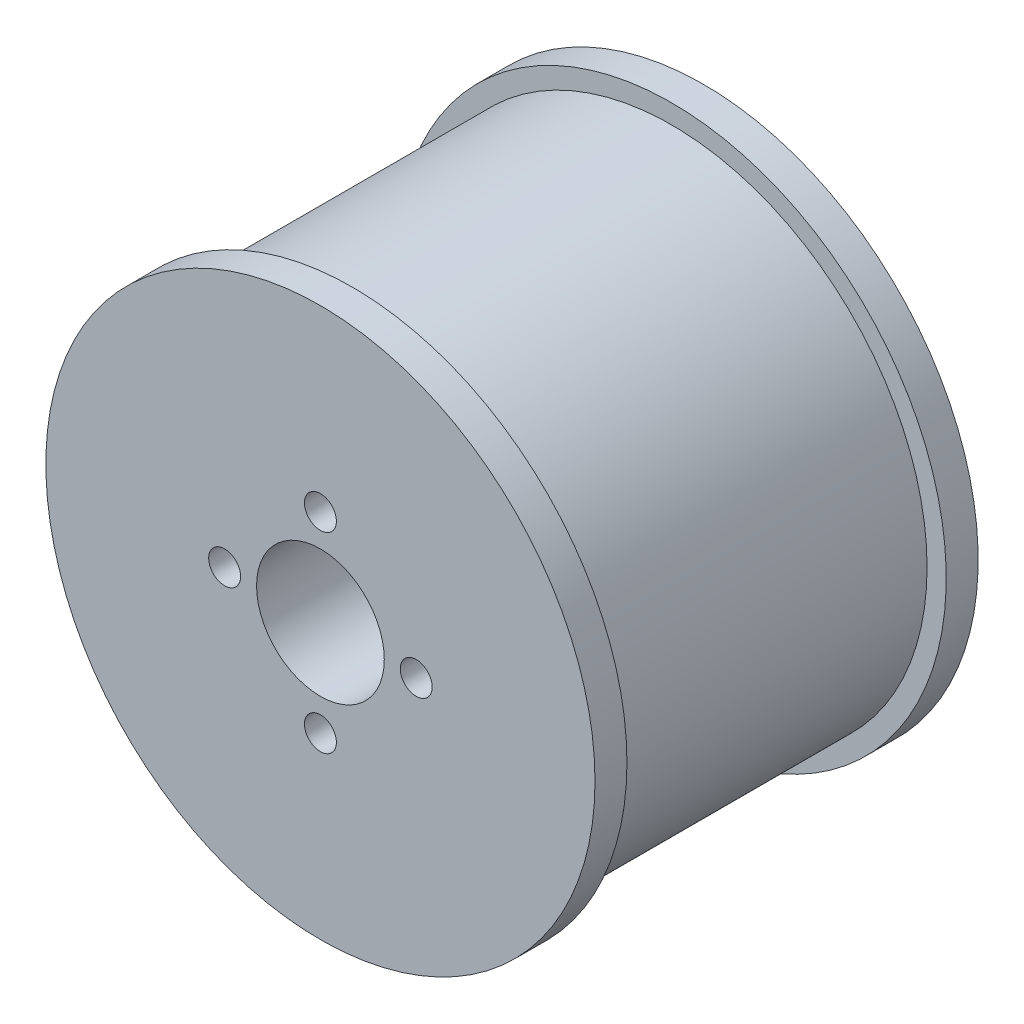
ISO-10303-21;
HEADER;
FILE_DESCRIPTION(('STEP AP214'),'2;1');
FILE_NAME('part.step','',(''),(''),'','','');
FILE_SCHEMA(('AUTOMOTIVE_DESIGN { 1 0 10303 214 1 1 1 1 }'));
ENDSEC;
DATA;
#1=APPLICATION_CONTEXT('core data for automotive mechanical design processes');
#2=APPLICATION_PROTOCOL_DEFINITION('international standard','automotive_design',2000,#1);
#3=PRODUCT_CONTEXT('',#1,'mechanical');
#4=PRODUCT('Part','Part','',(#3));
#5=PRODUCT_RELATED_PRODUCT_CATEGORY('part','',(#4));
#6=PRODUCT_DEFINITION_FORMATION('','',#4);
#7=PRODUCT_DEFINITION_CONTEXT('part definition',#1,'design');
#8=PRODUCT_DEFINITION('design','',#6,#7);
#9=PRODUCT_DEFINITION_SHAPE('','',#8);
#10=(LENGTH_UNIT() NAMED_UNIT(*) SI_UNIT(.MILLI.,.METRE.));
#11=(NAMED_UNIT(*) PLANE_ANGLE_UNIT() SI_UNIT($,.RADIAN.));
#12=(NAMED_UNIT(*) SI_UNIT($,.STERADIAN.) SOLID_ANGLE_UNIT());
#13=UNCERTAINTY_MEASURE_WITH_UNIT(LENGTH_MEASURE(1.E-05),#10,'distance_accuracy_value','');
#14=(GEOMETRIC_REPRESENTATION_CONTEXT(3) GLOBAL_UNCERTAINTY_ASSIGNED_CONTEXT((#13)) GLOBAL_UNIT_ASSIGNED_CONTEXT((#10,
#11,#12)) REPRESENTATION_CONTEXT('',''));
#15=CARTESIAN_POINT('',(0.,0.,0.));
#16=DIRECTION('',(0.,0.,1.));
#17=DIRECTION('',(1.,0.,0.));
#18=AXIS2_PLACEMENT_3D('',#15,#16,#17);
#19=CARTESIAN_POINT('',(0.,0.,50.));
#20=DIRECTION('',(0.,0.,-1.));
#21=DIRECTION('',(-1.,0.,0.));
#22=AXIS2_PLACEMENT_3D('',#19,#20,#21);
#23=CYLINDRICAL_SURFACE('',#22,40.);
#24=CARTESIAN_POINT('',(0.,0.,50.));
#25=DIRECTION('',(0.,0.,1.));
#26=DIRECTION('',(1.,0.,0.));
#27=AXIS2_PLACEMENT_3D('',#24,#25,#26);
#28=CIRCLE('',#27,40.);
#29=CARTESIAN_POINT('',(40.,0.,50.));
#30=VERTEX_POINT('',#29);
#31=EDGE_CURVE('E10',#30,#30,#28,.T.);
#32=ORIENTED_EDGE('',*,*,#31,.F.);
#33=EDGE_LOOP('',(#32));
#34=FACE_BOUND('',#33,.T.);
#35=CARTESIAN_POINT('',(0.,0.,0.));
#36=DIRECTION('',(0.,0.,1.));
#37=DIRECTION('',(1.,0.,0.));
#38=AXIS2_PLACEMENT_3D('',#35,#36,#37);
#39=CIRCLE('',#38,40.);
#40=CARTESIAN_POINT('',(40.,0.,0.));
#41=VERTEX_POINT('',#40);
#42=EDGE_CURVE('E44',#41,#41,#39,.T.);
#43=ORIENTED_EDGE('',*,*,#42,.T.);
#44=EDGE_LOOP('',(#43));
#45=FACE_BOUND('',#44,.T.);
#46=ADVANCED_FACE('F41',(#34,#45),#23,.T.);
#47=CARTESIAN_POINT('',(0.,0.,50.));
#48=DIRECTION('',(0.,0.,-1.));
#49=DIRECTION('',(-1.,0.,0.));
#50=AXIS2_PLACEMENT_3D('',#47,#48,#49);
#51=CYLINDRICAL_SURFACE('',#50,10.);
#52=CARTESIAN_POINT('',(0.,0.,55.));
#53=DIRECTION('',(0.,0.,1.));
#54=DIRECTION('',(1.,0.,0.));
#55=AXIS2_PLACEMENT_3D('',#52,#53,#54);
#56=CIRCLE('',#55,10.);
#57=CARTESIAN_POINT('',(10.,0.,55.));
#58=VERTEX_POINT('',#57);
#59=EDGE_CURVE('E59',#58,#58,#56,.T.);
#60=ORIENTED_EDGE('',*,*,#59,.T.);
#61=EDGE_LOOP('',(#60));
#62=FACE_BOUND('',#61,.T.);
#63=CARTESIAN_POINT('',(0.,0.,-5.));
#64=DIRECTION('',(0.,0.,-1.));
#65=DIRECTION('',(-1.,0.,0.));
#66=AXIS2_PLACEMENT_3D('',#63,#64,#65);
#67=CIRCLE('',#66,10.);
#68=CARTESIAN_POINT('',(-10.,0.,-5.));
#69=VERTEX_POINT('',#68);
#70=EDGE_CURVE('E69',#69,#69,#67,.T.);
#71=ORIENTED_EDGE('',*,*,#70,.T.);
#72=EDGE_LOOP('',(#71));
#73=FACE_BOUND('',#72,.T.);
#74=ADVANCED_FACE('F123',(#62,#73),#51,.F.);
#75=CARTESIAN_POINT('',(0.,0.,55.));
#76=DIRECTION('',(0.,0.,1.));
#77=DIRECTION('',(1.,0.,0.));
#78=AXIS2_PLACEMENT_3D('',#75,#76,#77);
#79=PLANE('',#78);
#80=CARTESIAN_POINT('',(0.,15.,55.));
#81=DIRECTION('',(0.,0.,1.));
#82=DIRECTION('',(1.,0.,0.));
#83=AXIS2_PLACEMENT_3D('',#80,#81,#82);
#84=CIRCLE('',#83,2.5);
#85=CARTESIAN_POINT('',(2.5,15.,55.));
#86=VERTEX_POINT('',#85);
#87=EDGE_CURVE('E101',#86,#86,#84,.T.);
#88=ORIENTED_EDGE('',*,*,#87,.F.);
#89=EDGE_LOOP('',(#88));
#90=FACE_BOUND('',#89,.T.);
#91=CARTESIAN_POINT('',(15.0000000000004,4.23570186157979E-13,55.));
#92=DIRECTION('',(0.,0.,1.));
#93=DIRECTION('',(1.,0.,0.));
#94=AXIS2_PLACEMENT_3D('',#91,#92,#93);
#95=CIRCLE('',#94,2.50000000000033);
#96=CARTESIAN_POINT('',(17.5000000000008,4.23570186157979E-13,55.));
#97=VERTEX_POINT('',#96);
#98=EDGE_CURVE('E97',#97,#97,#95,.T.);
#99=ORIENTED_EDGE('',*,*,#98,.F.);
#100=EDGE_LOOP('',(#99));
#101=FACE_BOUND('',#100,.T.);
#102=CARTESIAN_POINT('',(8.47140372315957E-13,-15.,55.));
#103=DIRECTION('',(0.,0.,1.));
#104=DIRECTION('',(1.,0.,0.));
#105=AXIS2_PLACEMENT_3D('',#102,#103,#104);
#106=CIRCLE('',#105,2.50000000000091);
#107=CARTESIAN_POINT('',(2.50000000000176,-15.,55.));
#108=VERTEX_POINT('',#107);
#109=EDGE_CURVE('E89',#108,#108,#106,.T.);
#110=ORIENTED_EDGE('',*,*,#109,.F.);
#111=EDGE_LOOP('',(#110));
#112=FACE_BOUND('',#111,.T.);
#113=CARTESIAN_POINT('',(-14.9999999999996,-4.254071563567E-13,55.));
#114=DIRECTION('',(0.,0.,1.));
#115=DIRECTION('',(1.,0.,0.));
#116=AXIS2_PLACEMENT_3D('',#113,#114,#115);
#117=CIRCLE('',#116,2.50000000000068);
#118=CARTESIAN_POINT('',(-12.4999999999989,-4.254071563567E-13,55.));
#119=VERTEX_POINT('',#118);
#120=EDGE_CURVE('E81',#119,#119,#117,.T.);
#121=ORIENTED_EDGE('',*,*,#120,.F.);
#122=EDGE_LOOP('',(#121));
#123=FACE_BOUND('',#122,.T.);
#124=CARTESIAN_POINT('',(0.,0.,55.));
#125=DIRECTION('',(0.,0.,1.));
#126=DIRECTION('',(1.,0.,0.));
#127=AXIS2_PLACEMENT_3D('',#124,#125,#126);
#128=CIRCLE('',#127,43.);
#129=CARTESIAN_POINT('',(43.,0.,55.));
#130=VERTEX_POINT('',#129);
#131=EDGE_CURVE('E49',#130,#130,#128,.T.);
#132=ORIENTED_EDGE('',*,*,#131,.T.);
#133=EDGE_LOOP('',(#132));
#134=FACE_BOUND('',#133,.T.);
#135=ORIENTED_EDGE('',*,*,#59,.F.);
#136=EDGE_LOOP('',(#135));
#137=FACE_BOUND('',#136,.T.);
#138=ADVANCED_FACE('F119',(#90,#101,#112,#123,#134,#137),#79,.T.);
#139=CARTESIAN_POINT('',(0.,0.,50.));
#140=DIRECTION('',(0.,0.,1.));
#141=DIRECTION('',(1.,0.,0.));
#142=AXIS2_PLACEMENT_3D('',#139,#140,#141);
#143=PLANE('',#142);
#144=ORIENTED_EDGE('',*,*,#31,.T.);
#145=EDGE_LOOP('',(#144));
#146=FACE_BOUND('',#145,.T.);
#147=CARTESIAN_POINT('',(0.,0.,50.));
#148=DIRECTION('',(0.,0.,1.));
#149=DIRECTION('',(1.,0.,0.));
#150=AXIS2_PLACEMENT_3D('',#147,#148,#149);
#151=CIRCLE('',#150,43.);
#152=CARTESIAN_POINT('',(43.,0.,50.));
#153=VERTEX_POINT('',#152);
#154=EDGE_CURVE('E54',#153,#153,#151,.T.);
#155=ORIENTED_EDGE('',*,*,#154,.F.);
#156=EDGE_LOOP('',(#155));
#157=FACE_BOUND('',#156,.T.);
#158=ADVANCED_FACE('F122',(#146,#157),#143,.F.);
#159=CARTESIAN_POINT('',(0.,0.,55.));
#160=DIRECTION('',(0.,0.,-1.));
#161=DIRECTION('',(-1.,0.,0.));
#162=AXIS2_PLACEMENT_3D('',#159,#160,#161);
#163=CYLINDRICAL_SURFACE('',#162,43.);
#164=ORIENTED_EDGE('',*,*,#131,.F.);
#165=EDGE_LOOP('',(#164));
#166=FACE_BOUND('',#165,.T.);
#167=ORIENTED_EDGE('',*,*,#154,.T.);
#168=EDGE_LOOP('',(#167));
#169=FACE_BOUND('',#168,.T.);
#170=ADVANCED_FACE('F141',(#166,#169),#163,.T.);
#171=CARTESIAN_POINT('',(0.,0.,-5.));
#172=DIRECTION('',(0.,0.,-1.));
#173=DIRECTION('',(-1.,0.,0.));
#174=AXIS2_PLACEMENT_3D('',#171,#172,#173);
#175=PLANE('',#174);
#176=CARTESIAN_POINT('',(0.,15.,-5.));
#177=DIRECTION('',(0.,0.,1.));
#178=DIRECTION('',(1.,0.,0.));
#179=AXIS2_PLACEMENT_3D('',#176,#177,#178);
#180=CIRCLE('',#179,2.5);
#181=CARTESIAN_POINT('',(2.5,15.,-5.));
#182=VERTEX_POINT('',#181);
#183=EDGE_CURVE('E76',#182,#182,#180,.T.);
#184=ORIENTED_EDGE('',*,*,#183,.T.);
#185=EDGE_LOOP('',(#184));
#186=FACE_BOUND('',#185,.T.);
#187=CARTESIAN_POINT('',(15.0000000000004,4.23570186157979E-13,-5.));
#188=DIRECTION('',(0.,0.,1.));
#189=DIRECTION('',(1.,0.,0.));
#190=AXIS2_PLACEMENT_3D('',#187,#188,#189);
#191=CIRCLE('',#190,2.50000000000033);
#192=CARTESIAN_POINT('',(17.5000000000008,4.23570186157979E-13,-5.));
#193=VERTEX_POINT('',#192);
#194=EDGE_CURVE('E93',#193,#193,#191,.T.);
#195=ORIENTED_EDGE('',*,*,#194,.T.);
#196=EDGE_LOOP('',(#195));
#197=FACE_BOUND('',#196,.T.);
#198=CARTESIAN_POINT('',(8.47140372315957E-13,-15.,-5.));
#199=DIRECTION('',(0.,0.,1.));
#200=DIRECTION('',(1.,0.,0.));
#201=AXIS2_PLACEMENT_3D('',#198,#199,#200);
#202=CIRCLE('',#201,2.50000000000091);
#203=CARTESIAN_POINT('',(2.50000000000176,-15.,-5.));
#204=VERTEX_POINT('',#203);
#205=EDGE_CURVE('E85',#204,#204,#202,.T.);
#206=ORIENTED_EDGE('',*,*,#205,.T.);
#207=EDGE_LOOP('',(#206));
#208=FACE_BOUND('',#207,.T.);
#209=CARTESIAN_POINT('',(-14.9999999999996,-4.254071563567E-13,-5.));
#210=DIRECTION('',(0.,0.,1.));
#211=DIRECTION('',(1.,0.,0.));
#212=AXIS2_PLACEMENT_3D('',#209,#210,#211);
#213=CIRCLE('',#212,2.50000000000068);
#214=CARTESIAN_POINT('',(-12.4999999999989,-4.254071563567E-13,-5.));
#215=VERTEX_POINT('',#214);
#216=EDGE_CURVE('E77',#215,#215,#213,.T.);
#217=ORIENTED_EDGE('',*,*,#216,.T.);
#218=EDGE_LOOP('',(#217));
#219=FACE_BOUND('',#218,.T.);
#220=CARTESIAN_POINT('',(0.,0.,-5.));
#221=DIRECTION('',(0.,0.,-1.));
#222=DIRECTION('',(-1.,0.,0.));
#223=AXIS2_PLACEMENT_3D('',#220,#221,#222);
#224=CIRCLE('',#223,43.);
#225=CARTESIAN_POINT('',(-43.,0.,-5.));
#226=VERTEX_POINT('',#225);
#227=EDGE_CURVE('E68',#226,#226,#224,.T.);
#228=ORIENTED_EDGE('',*,*,#227,.T.);
#229=EDGE_LOOP('',(#228));
#230=FACE_BOUND('',#229,.T.);
#231=ORIENTED_EDGE('',*,*,#70,.F.);
#232=EDGE_LOOP('',(#231));
#233=FACE_BOUND('',#232,.T.);
#234=ADVANCED_FACE('F109',(#186,#197,#208,#219,#230,#233),#175,.T.);
#235=CARTESIAN_POINT('',(0.,0.,0.));
#236=DIRECTION('',(0.,0.,-1.));
#237=DIRECTION('',(-1.,0.,0.));
#238=AXIS2_PLACEMENT_3D('',#235,#236,#237);
#239=PLANE('',#238);
#240=ORIENTED_EDGE('',*,*,#42,.F.);
#241=EDGE_LOOP('',(#240));
#242=FACE_BOUND('',#241,.T.);
#243=CARTESIAN_POINT('',(0.,0.,0.));
#244=DIRECTION('',(0.,0.,-1.));
#245=DIRECTION('',(-1.,0.,0.));
#246=AXIS2_PLACEMENT_3D('',#243,#244,#245);
#247=CIRCLE('',#246,43.);
#248=CARTESIAN_POINT('',(-43.,0.,0.));
#249=VERTEX_POINT('',#248);
#250=EDGE_CURVE('E64',#249,#249,#247,.T.);
#251=ORIENTED_EDGE('',*,*,#250,.F.);
#252=EDGE_LOOP('',(#251));
#253=FACE_BOUND('',#252,.T.);
#254=ADVANCED_FACE('F140',(#242,#253),#239,.F.);
#255=CARTESIAN_POINT('',(0.,0.,-5.));
#256=DIRECTION('',(0.,0.,1.));
#257=DIRECTION('',(1.,0.,0.));
#258=AXIS2_PLACEMENT_3D('',#255,#256,#257);
#259=CYLINDRICAL_SURFACE('',#258,43.);
#260=ORIENTED_EDGE('',*,*,#227,.F.);
#261=EDGE_LOOP('',(#260));
#262=FACE_BOUND('',#261,.T.);
#263=ORIENTED_EDGE('',*,*,#250,.T.);
#264=EDGE_LOOP('',(#263));
#265=FACE_BOUND('',#264,.T.);
#266=ADVANCED_FACE('F147',(#262,#265),#259,.T.);
#267=CARTESIAN_POINT('',(-14.9999999999996,-4.254071563567E-13,-5.));
#268=DIRECTION('',(0.,0.,1.));
#269=DIRECTION('',(1.,0.,0.));
#270=AXIS2_PLACEMENT_3D('',#267,#268,#269);
#271=CYLINDRICAL_SURFACE('',#270,2.50000000000068);
#272=ORIENTED_EDGE('',*,*,#216,.F.);
#273=EDGE_LOOP('',(#272));
#274=FACE_BOUND('',#273,.T.);
#275=ORIENTED_EDGE('',*,*,#120,.T.);
#276=EDGE_LOOP('',(#275));
#277=FACE_BOUND('',#276,.T.);
#278=ADVANCED_FACE('F165',(#274,#277),#271,.F.);
#279=CARTESIAN_POINT('',(8.47140372315957E-13,-15.,-5.));
#280=DIRECTION('',(0.,0.,1.));
#281=DIRECTION('',(1.,0.,0.));
#282=AXIS2_PLACEMENT_3D('',#279,#280,#281);
#283=CYLINDRICAL_SURFACE('',#282,2.50000000000091);
#284=ORIENTED_EDGE('',*,*,#205,.F.);
#285=EDGE_LOOP('',(#284));
#286=FACE_BOUND('',#285,.T.);
#287=ORIENTED_EDGE('',*,*,#109,.T.);
#288=EDGE_LOOP('',(#287));
#289=FACE_BOUND('',#288,.T.);
#290=ADVANCED_FACE('F171',(#286,#289),#283,.F.);
#291=CARTESIAN_POINT('',(15.0000000000004,4.23570186157979E-13,-5.));
#292=DIRECTION('',(0.,0.,1.));
#293=DIRECTION('',(1.,0.,0.));
#294=AXIS2_PLACEMENT_3D('',#291,#292,#293);
#295=CYLINDRICAL_SURFACE('',#294,2.50000000000033);
#296=ORIENTED_EDGE('',*,*,#194,.F.);
#297=EDGE_LOOP('',(#296));
#298=FACE_BOUND('',#297,.T.);
#299=ORIENTED_EDGE('',*,*,#98,.T.);
#300=EDGE_LOOP('',(#299));
#301=FACE_BOUND('',#300,.T.);
#302=ADVANCED_FACE('F115',(#298,#301),#295,.F.);
#303=CARTESIAN_POINT('',(0.,15.,-5.));
#304=DIRECTION('',(0.,0.,1.));
#305=DIRECTION('',(1.,0.,0.));
#306=AXIS2_PLACEMENT_3D('',#303,#304,#305);
#307=CYLINDRICAL_SURFACE('',#306,2.5);
#308=ORIENTED_EDGE('',*,*,#183,.F.);
#309=EDGE_LOOP('',(#308));
#310=FACE_BOUND('',#309,.T.);
#311=ORIENTED_EDGE('',*,*,#87,.T.);
#312=EDGE_LOOP('',(#311));
#313=FACE_BOUND('',#312,.T.);
#314=ADVANCED_FACE('F112',(#310,#313),#307,.F.);
#315=CLOSED_SHELL('',(#46,#74,#138,#158,#170,#234,#254,#266,#278,#290,#302,#314));
#316=MANIFOLD_SOLID_BREP('B2',#315);
#317=ADVANCED_BREP_SHAPE_REPRESENTATION('',(#18,#316),#14);
#318=SHAPE_DEFINITION_REPRESENTATION(#9,#317);
ENDSEC;
END-ISO-10303-21;
